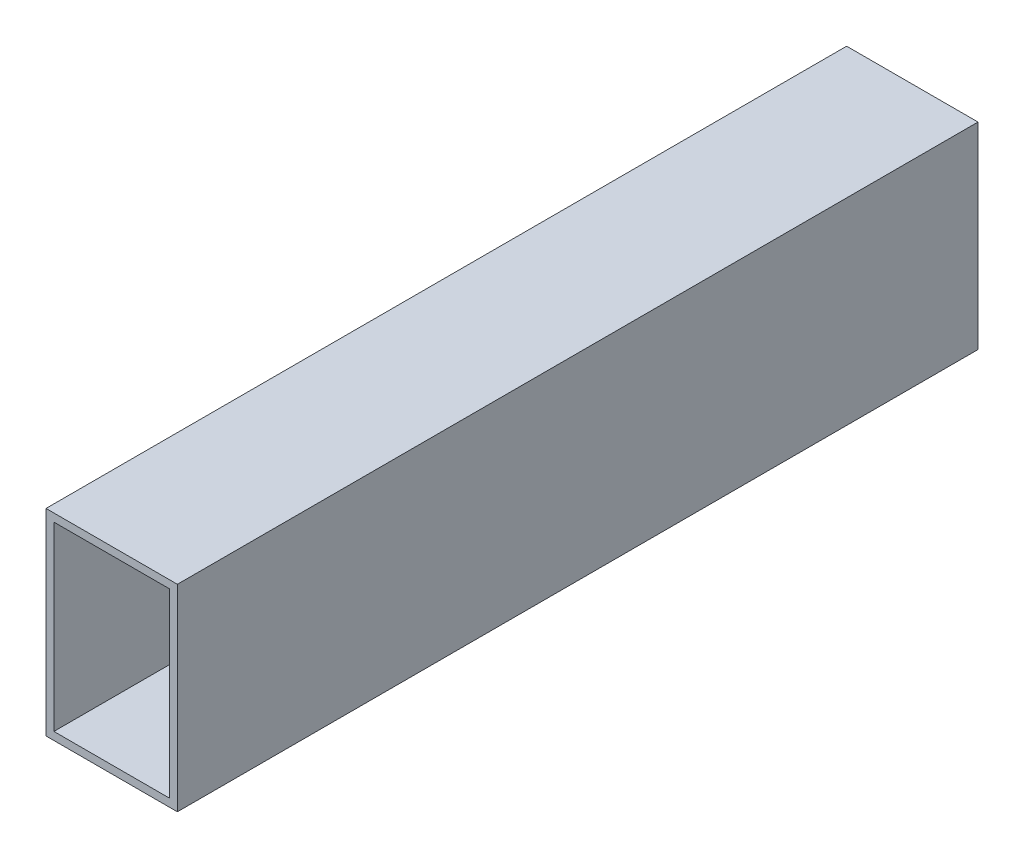
ISO-10303-21;
HEADER;
FILE_DESCRIPTION(('STEP AP214'),'2;1');
FILE_NAME('part.step','',(''),(''),'','','');
FILE_SCHEMA(('AUTOMOTIVE_DESIGN { 1 0 10303 214 1 1 1 1 }'));
ENDSEC;
DATA;
#1=APPLICATION_CONTEXT('core data for automotive mechanical design processes');
#2=APPLICATION_PROTOCOL_DEFINITION('international standard','automotive_design',2000,#1);
#3=PRODUCT_CONTEXT('',#1,'mechanical');
#4=PRODUCT('Part','Part','',(#3));
#5=PRODUCT_RELATED_PRODUCT_CATEGORY('part','',(#4));
#6=PRODUCT_DEFINITION_FORMATION('','',#4);
#7=PRODUCT_DEFINITION_CONTEXT('part definition',#1,'design');
#8=PRODUCT_DEFINITION('design','',#6,#7);
#9=PRODUCT_DEFINITION_SHAPE('','',#8);
#10=(LENGTH_UNIT() NAMED_UNIT(*) SI_UNIT(.MILLI.,.METRE.));
#11=(NAMED_UNIT(*) PLANE_ANGLE_UNIT() SI_UNIT($,.RADIAN.));
#12=(NAMED_UNIT(*) SI_UNIT($,.STERADIAN.) SOLID_ANGLE_UNIT());
#13=UNCERTAINTY_MEASURE_WITH_UNIT(LENGTH_MEASURE(1.E-05),#10,'distance_accuracy_value','');
#14=(GEOMETRIC_REPRESENTATION_CONTEXT(3) GLOBAL_UNCERTAINTY_ASSIGNED_CONTEXT((#13)) GLOBAL_UNIT_ASSIGNED_CONTEXT((#10,
#11,#12)) REPRESENTATION_CONTEXT('',''));
#15=CARTESIAN_POINT('',(0.,0.,0.));
#16=DIRECTION('',(0.,0.,1.));
#17=DIRECTION('',(1.,0.,0.));
#18=AXIS2_PLACEMENT_3D('',#15,#16,#17);
#19=CARTESIAN_POINT('',(0.,0.,609.438147849529));
#20=DIRECTION('',(0.,0.,-1.));
#21=DIRECTION('',(-1.,0.,0.));
#22=AXIS2_PLACEMENT_3D('',#19,#20,#21);
#23=PLANE('',#22);
#24=DIRECTION('',(0.,-1.,0.));
#25=VECTOR('',#24,1.);
#26=CARTESIAN_POINT('',(-50.,-75.,609.438147849529));
#27=LINE('',#26,#25);
#28=CARTESIAN_POINT('',(-50.,74.9999999999999,609.438147849529));
#29=VERTEX_POINT('',#28);
#30=CARTESIAN_POINT('',(-50.,-75.,609.438147849529));
#31=VERTEX_POINT('',#30);
#32=EDGE_CURVE('E139',#29,#31,#27,.T.);
#33=ORIENTED_EDGE('',*,*,#32,.T.);
#34=DIRECTION('',(1.,0.,0.));
#35=VECTOR('',#34,1.);
#36=CARTESIAN_POINT('',(-50.,-75.,609.438147849529));
#37=LINE('',#36,#35);
#38=CARTESIAN_POINT('',(50.,-75.,609.438147849529));
#39=VERTEX_POINT('',#38);
#40=EDGE_CURVE('E141',#31,#39,#37,.T.);
#41=ORIENTED_EDGE('',*,*,#40,.T.);
#42=DIRECTION('',(0.,1.,0.));
#43=VECTOR('',#42,1.);
#44=CARTESIAN_POINT('',(50.,-75.,609.438147849529));
#45=LINE('',#44,#43);
#46=CARTESIAN_POINT('',(50.,75.,609.438147849529));
#47=VERTEX_POINT('',#46);
#48=EDGE_CURVE('E148',#39,#47,#45,.T.);
#49=ORIENTED_EDGE('',*,*,#48,.T.);
#50=DIRECTION('',(-1.,0.,0.));
#51=VECTOR('',#50,1.);
#52=CARTESIAN_POINT('',(-50.,74.9999999999999,609.438147849529));
#53=LINE('',#52,#51);
#54=EDGE_CURVE('E146',#47,#29,#53,.T.);
#55=ORIENTED_EDGE('',*,*,#54,.T.);
#56=EDGE_LOOP('',(#33,#41,#49,#55));
#57=FACE_BOUND('',#56,.T.);
#58=DIRECTION('',(0.,-1.,0.));
#59=VECTOR('',#58,1.);
#60=CARTESIAN_POINT('',(-44.,-69.,609.438147849529));
#61=LINE('',#60,#59);
#62=CARTESIAN_POINT('',(-44.,69.,609.438147849529));
#63=VERTEX_POINT('',#62);
#64=CARTESIAN_POINT('',(-44.,-69.,609.438147849529));
#65=VERTEX_POINT('',#64);
#66=EDGE_CURVE('E102',#63,#65,#61,.T.);
#67=ORIENTED_EDGE('',*,*,#66,.F.);
#68=DIRECTION('',(-1.,0.,0.));
#69=VECTOR('',#68,1.);
#70=CARTESIAN_POINT('',(-44.,69.,609.438147849529));
#71=LINE('',#70,#69);
#72=CARTESIAN_POINT('',(44.,69.,609.438147849529));
#73=VERTEX_POINT('',#72);
#74=EDGE_CURVE('E127',#73,#63,#71,.T.);
#75=ORIENTED_EDGE('',*,*,#74,.F.);
#76=DIRECTION('',(0.,1.,0.));
#77=VECTOR('',#76,1.);
#78=CARTESIAN_POINT('',(44.,-69.,609.438147849529));
#79=LINE('',#78,#77);
#80=CARTESIAN_POINT('',(44.,-69.,609.438147849529));
#81=VERTEX_POINT('',#80);
#82=EDGE_CURVE('E123',#81,#73,#79,.T.);
#83=ORIENTED_EDGE('',*,*,#82,.F.);
#84=DIRECTION('',(1.,0.,0.));
#85=VECTOR('',#84,1.);
#86=CARTESIAN_POINT('',(-44.,-69.,609.438147849529));
#87=LINE('',#86,#85);
#88=EDGE_CURVE('E115',#65,#81,#87,.T.);
#89=ORIENTED_EDGE('',*,*,#88,.F.);
#90=EDGE_LOOP('',(#67,#75,#83,#89));
#91=FACE_BOUND('',#90,.T.);
#92=ADVANCED_FACE('F39',(#57,#91),#23,.F.);
#93=CARTESIAN_POINT('',(0.,0.,0.));
#94=DIRECTION('',(0.,0.,-1.));
#95=DIRECTION('',(-1.,0.,0.));
#96=AXIS2_PLACEMENT_3D('',#93,#94,#95);
#97=PLANE('',#96);
#98=DIRECTION('',(0.,-1.,0.));
#99=VECTOR('',#98,1.);
#100=CARTESIAN_POINT('',(-50.,-75.,0.));
#101=LINE('',#100,#99);
#102=CARTESIAN_POINT('',(-50.,74.9999999999999,0.));
#103=VERTEX_POINT('',#102);
#104=CARTESIAN_POINT('',(-50.,-75.,0.));
#105=VERTEX_POINT('',#104);
#106=EDGE_CURVE('E119',#103,#105,#101,.T.);
#107=ORIENTED_EDGE('',*,*,#106,.F.);
#108=DIRECTION('',(-1.,0.,0.));
#109=VECTOR('',#108,1.);
#110=CARTESIAN_POINT('',(-50.,74.9999999999999,0.));
#111=LINE('',#110,#109);
#112=CARTESIAN_POINT('',(50.,75.,0.));
#113=VERTEX_POINT('',#112);
#114=EDGE_CURVE('E145',#113,#103,#111,.T.);
#115=ORIENTED_EDGE('',*,*,#114,.F.);
#116=DIRECTION('',(0.,1.,0.));
#117=VECTOR('',#116,1.);
#118=CARTESIAN_POINT('',(50.,-75.,0.));
#119=LINE('',#118,#117);
#120=CARTESIAN_POINT('',(50.,-75.,0.));
#121=VERTEX_POINT('',#120);
#122=EDGE_CURVE('E154',#121,#113,#119,.T.);
#123=ORIENTED_EDGE('',*,*,#122,.F.);
#124=DIRECTION('',(1.,0.,0.));
#125=VECTOR('',#124,1.);
#126=CARTESIAN_POINT('',(-50.,-75.,0.));
#127=LINE('',#126,#125);
#128=EDGE_CURVE('E153',#105,#121,#127,.T.);
#129=ORIENTED_EDGE('',*,*,#128,.F.);
#130=EDGE_LOOP('',(#107,#115,#123,#129));
#131=FACE_BOUND('',#130,.T.);
#132=DIRECTION('',(-1.,0.,0.));
#133=VECTOR('',#132,1.);
#134=CARTESIAN_POINT('',(-44.,69.,0.));
#135=LINE('',#134,#133);
#136=CARTESIAN_POINT('',(44.,69.,0.));
#137=VERTEX_POINT('',#136);
#138=CARTESIAN_POINT('',(-44.,69.,0.));
#139=VERTEX_POINT('',#138);
#140=EDGE_CURVE('E114',#137,#139,#135,.T.);
#141=ORIENTED_EDGE('',*,*,#140,.T.);
#142=DIRECTION('',(0.,-1.,0.));
#143=VECTOR('',#142,1.);
#144=CARTESIAN_POINT('',(-44.,-69.,0.));
#145=LINE('',#144,#143);
#146=CARTESIAN_POINT('',(-44.,-69.,0.));
#147=VERTEX_POINT('',#146);
#148=EDGE_CURVE('E65',#139,#147,#145,.T.);
#149=ORIENTED_EDGE('',*,*,#148,.T.);
#150=DIRECTION('',(1.,0.,0.));
#151=VECTOR('',#150,1.);
#152=CARTESIAN_POINT('',(-44.,-69.,0.));
#153=LINE('',#152,#151);
#154=CARTESIAN_POINT('',(44.,-69.,0.));
#155=VERTEX_POINT('',#154);
#156=EDGE_CURVE('E118',#147,#155,#153,.T.);
#157=ORIENTED_EDGE('',*,*,#156,.T.);
#158=DIRECTION('',(0.,1.,0.));
#159=VECTOR('',#158,1.);
#160=CARTESIAN_POINT('',(44.,-69.,0.));
#161=LINE('',#160,#159);
#162=EDGE_CURVE('E135',#155,#137,#161,.T.);
#163=ORIENTED_EDGE('',*,*,#162,.T.);
#164=EDGE_LOOP('',(#141,#149,#157,#163));
#165=FACE_BOUND('',#164,.T.);
#166=ADVANCED_FACE('F172',(#131,#165),#97,.T.);
#167=CARTESIAN_POINT('',(-50.,-75.,609.438147849529));
#168=DIRECTION('',(1.,0.,0.));
#169=DIRECTION('',(0.,1.,0.));
#170=AXIS2_PLACEMENT_3D('',#167,#168,#169);
#171=PLANE('',#170);
#172=ORIENTED_EDGE('',*,*,#106,.T.);
#173=DIRECTION('',(0.,0.,-1.));
#174=VECTOR('',#173,1.);
#175=CARTESIAN_POINT('',(-50.,-75.,609.438147849529));
#176=LINE('',#175,#174);
#177=EDGE_CURVE('E11',#31,#105,#176,.T.);
#178=ORIENTED_EDGE('',*,*,#177,.F.);
#179=ORIENTED_EDGE('',*,*,#32,.F.);
#180=DIRECTION('',(0.,0.,-1.));
#181=VECTOR('',#180,1.);
#182=CARTESIAN_POINT('',(-50.,74.9999999999999,609.438147849529));
#183=LINE('',#182,#181);
#184=EDGE_CURVE('E147',#29,#103,#183,.T.);
#185=ORIENTED_EDGE('',*,*,#184,.T.);
#186=EDGE_LOOP('',(#172,#178,#179,#185));
#187=FACE_BOUND('',#186,.T.);
#188=ADVANCED_FACE('F41',(#187),#171,.F.);
#189=CARTESIAN_POINT('',(-50.,-75.,609.438147849529));
#190=DIRECTION('',(0.,1.,0.));
#191=DIRECTION('',(0.,0.,1.));
#192=AXIS2_PLACEMENT_3D('',#189,#190,#191);
#193=PLANE('',#192);
#194=ORIENTED_EDGE('',*,*,#128,.T.);
#195=DIRECTION('',(0.,0.,-1.));
#196=VECTOR('',#195,1.);
#197=CARTESIAN_POINT('',(50.,-75.,609.438147849529));
#198=LINE('',#197,#196);
#199=EDGE_CURVE('E50',#39,#121,#198,.T.);
#200=ORIENTED_EDGE('',*,*,#199,.F.);
#201=ORIENTED_EDGE('',*,*,#40,.F.);
#202=ORIENTED_EDGE('',*,*,#177,.T.);
#203=EDGE_LOOP('',(#194,#200,#201,#202));
#204=FACE_BOUND('',#203,.T.);
#205=ADVANCED_FACE('F181',(#204),#193,.F.);
#206=CARTESIAN_POINT('',(50.,-75.,609.438147849529));
#207=DIRECTION('',(-1.,0.,0.));
#208=DIRECTION('',(0.,-1.,0.));
#209=AXIS2_PLACEMENT_3D('',#206,#207,#208);
#210=PLANE('',#209);
#211=ORIENTED_EDGE('',*,*,#122,.T.);
#212=DIRECTION('',(0.,0.,-1.));
#213=VECTOR('',#212,1.);
#214=CARTESIAN_POINT('',(50.,75.,609.438147849529));
#215=LINE('',#214,#213);
#216=EDGE_CURVE('E159',#47,#113,#215,.T.);
#217=ORIENTED_EDGE('',*,*,#216,.F.);
#218=ORIENTED_EDGE('',*,*,#48,.F.);
#219=ORIENTED_EDGE('',*,*,#199,.T.);
#220=EDGE_LOOP('',(#211,#217,#218,#219));
#221=FACE_BOUND('',#220,.T.);
#222=ADVANCED_FACE('F170',(#221),#210,.F.);
#223=CARTESIAN_POINT('',(-50.,74.9999999999999,609.438147849529));
#224=DIRECTION('',(0.,-1.,0.));
#225=DIRECTION('',(1.,0.,0.));
#226=AXIS2_PLACEMENT_3D('',#223,#224,#225);
#227=PLANE('',#226);
#228=ORIENTED_EDGE('',*,*,#114,.T.);
#229=ORIENTED_EDGE('',*,*,#184,.F.);
#230=ORIENTED_EDGE('',*,*,#54,.F.);
#231=ORIENTED_EDGE('',*,*,#216,.T.);
#232=EDGE_LOOP('',(#228,#229,#230,#231));
#233=FACE_BOUND('',#232,.T.);
#234=ADVANCED_FACE('F177',(#233),#227,.F.);
#235=CARTESIAN_POINT('',(-44.,-69.,609.438147849529));
#236=DIRECTION('',(1.,0.,0.));
#237=DIRECTION('',(0.,0.,-1.));
#238=AXIS2_PLACEMENT_3D('',#235,#236,#237);
#239=PLANE('',#238);
#240=ORIENTED_EDGE('',*,*,#148,.F.);
#241=DIRECTION('',(0.,0.,-1.));
#242=VECTOR('',#241,1.);
#243=CARTESIAN_POINT('',(-44.,69.,609.438147849529));
#244=LINE('',#243,#242);
#245=EDGE_CURVE('E107',#63,#139,#244,.T.);
#246=ORIENTED_EDGE('',*,*,#245,.F.);
#247=ORIENTED_EDGE('',*,*,#66,.T.);
#248=DIRECTION('',(0.,0.,-1.));
#249=VECTOR('',#248,1.);
#250=CARTESIAN_POINT('',(-44.,-69.,609.438147849529));
#251=LINE('',#250,#249);
#252=EDGE_CURVE('E110',#65,#147,#251,.T.);
#253=ORIENTED_EDGE('',*,*,#252,.T.);
#254=EDGE_LOOP('',(#240,#246,#247,#253));
#255=FACE_BOUND('',#254,.T.);
#256=ADVANCED_FACE('F106',(#255),#239,.T.);
#257=CARTESIAN_POINT('',(-44.,-69.,609.438147849529));
#258=DIRECTION('',(0.,1.,0.));
#259=DIRECTION('',(0.,0.,1.));
#260=AXIS2_PLACEMENT_3D('',#257,#258,#259);
#261=PLANE('',#260);
#262=ORIENTED_EDGE('',*,*,#156,.F.);
#263=ORIENTED_EDGE('',*,*,#252,.F.);
#264=ORIENTED_EDGE('',*,*,#88,.T.);
#265=DIRECTION('',(0.,0.,-1.));
#266=VECTOR('',#265,1.);
#267=CARTESIAN_POINT('',(44.,-69.,609.438147849529));
#268=LINE('',#267,#266);
#269=EDGE_CURVE('E121',#81,#155,#268,.T.);
#270=ORIENTED_EDGE('',*,*,#269,.T.);
#271=EDGE_LOOP('',(#262,#263,#264,#270));
#272=FACE_BOUND('',#271,.T.);
#273=ADVANCED_FACE('F116',(#272),#261,.T.);
#274=CARTESIAN_POINT('',(44.,-69.,609.438147849529));
#275=DIRECTION('',(-1.,0.,0.));
#276=DIRECTION('',(0.,0.,1.));
#277=AXIS2_PLACEMENT_3D('',#274,#275,#276);
#278=PLANE('',#277);
#279=ORIENTED_EDGE('',*,*,#162,.F.);
#280=ORIENTED_EDGE('',*,*,#269,.F.);
#281=ORIENTED_EDGE('',*,*,#82,.T.);
#282=DIRECTION('',(0.,0.,-1.));
#283=VECTOR('',#282,1.);
#284=CARTESIAN_POINT('',(44.,69.,609.438147849529));
#285=LINE('',#284,#283);
#286=EDGE_CURVE('E53',#73,#137,#285,.T.);
#287=ORIENTED_EDGE('',*,*,#286,.T.);
#288=EDGE_LOOP('',(#279,#280,#281,#287));
#289=FACE_BOUND('',#288,.T.);
#290=ADVANCED_FACE('F206',(#289),#278,.T.);
#291=CARTESIAN_POINT('',(-44.,69.,609.438147849529));
#292=DIRECTION('',(0.,-1.,0.));
#293=DIRECTION('',(0.,0.,-1.));
#294=AXIS2_PLACEMENT_3D('',#291,#292,#293);
#295=PLANE('',#294);
#296=ORIENTED_EDGE('',*,*,#140,.F.);
#297=ORIENTED_EDGE('',*,*,#286,.F.);
#298=ORIENTED_EDGE('',*,*,#74,.T.);
#299=ORIENTED_EDGE('',*,*,#245,.T.);
#300=EDGE_LOOP('',(#296,#297,#298,#299));
#301=FACE_BOUND('',#300,.T.);
#302=ADVANCED_FACE('F209',(#301),#295,.T.);
#303=CLOSED_SHELL('',(#92,#166,#188,#205,#222,#234,#256,#273,#290,#302));
#304=MANIFOLD_SOLID_BREP('B2',#303);
#305=ADVANCED_BREP_SHAPE_REPRESENTATION('',(#18,#304),#14);
#306=SHAPE_DEFINITION_REPRESENTATION(#9,#305);
ENDSEC;
END-ISO-10303-21;
